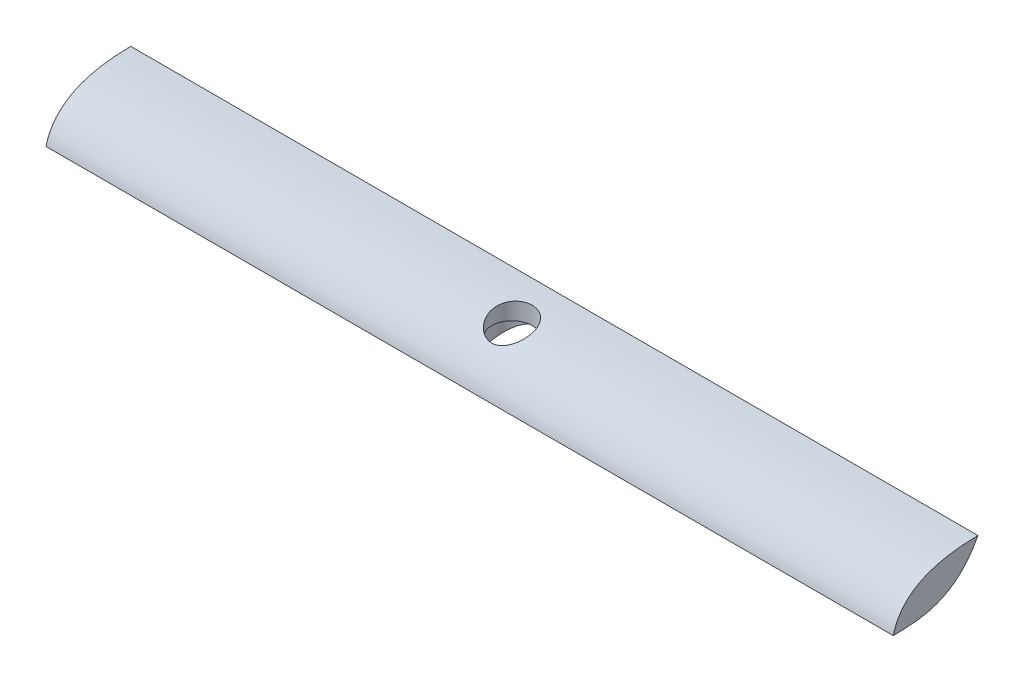
ISO-10303-21;
HEADER;
FILE_DESCRIPTION(('STEP AP214'),'2;1');
FILE_NAME('part.step','',(''),(''),'','','');
FILE_SCHEMA(('AUTOMOTIVE_DESIGN { 1 0 10303 214 1 1 1 1 }'));
ENDSEC;
DATA;
#1=APPLICATION_CONTEXT('core data for automotive mechanical design processes');
#2=APPLICATION_PROTOCOL_DEFINITION('international standard','automotive_design',2000,#1);
#3=PRODUCT_CONTEXT('',#1,'mechanical');
#4=PRODUCT('Part','Part','',(#3));
#5=PRODUCT_RELATED_PRODUCT_CATEGORY('part','',(#4));
#6=PRODUCT_DEFINITION_FORMATION('','',#4);
#7=PRODUCT_DEFINITION_CONTEXT('part definition',#1,'design');
#8=PRODUCT_DEFINITION('design','',#6,#7);
#9=PRODUCT_DEFINITION_SHAPE('','',#8);
#10=(LENGTH_UNIT() NAMED_UNIT(*) SI_UNIT(.MILLI.,.METRE.));
#11=(NAMED_UNIT(*) PLANE_ANGLE_UNIT() SI_UNIT($,.RADIAN.));
#12=(NAMED_UNIT(*) SI_UNIT($,.STERADIAN.) SOLID_ANGLE_UNIT());
#13=UNCERTAINTY_MEASURE_WITH_UNIT(LENGTH_MEASURE(1.E-05),#10,'distance_accuracy_value','');
#14=(GEOMETRIC_REPRESENTATION_CONTEXT(3) GLOBAL_UNCERTAINTY_ASSIGNED_CONTEXT((#13)) GLOBAL_UNIT_ASSIGNED_CONTEXT((#10,
#11,#12)) REPRESENTATION_CONTEXT('',''));
#15=CARTESIAN_POINT('',(0.,0.,0.));
#16=DIRECTION('',(0.,0.,1.));
#17=DIRECTION('',(1.,0.,0.));
#18=AXIS2_PLACEMENT_3D('',#15,#16,#17);
#19=CARTESIAN_POINT('',(-65.,0.,-6.49999999999999));
#20=DIRECTION('',(-1.,0.,0.));
#21=DIRECTION('',(0.,0.,1.));
#22=AXIS2_PLACEMENT_3D('',#19,#20,#21);
#23=PLANE('',#22);
#24=CARTESIAN_POINT('',(-65.,6.8,-6.49999999999999));
#25=CARTESIAN_POINT('',(-65.,6.73763604376101,6.58250357096353));
#26=CARTESIAN_POINT('',(-65.,-2.29750378674827,6.79812167278829));
#27=B_SPLINE_CURVE_WITH_KNOTS('',2,(#24,#25,#26),.UNSPECIFIED.,.F.,.F.,(3,3),(0.,1.),.UNSPECIFIED.);
#28=CARTESIAN_POINT('',(-65.,6.8,-6.49999999999999));
#29=VERTEX_POINT('',#28);
#30=CARTESIAN_POINT('',(-65.,0.,6.50000000000001));
#31=VERTEX_POINT('',#30);
#32=EDGE_CURVE('E73',#29,#31,#27,.T.);
#33=ORIENTED_EDGE('',*,*,#32,.F.);
#34=CARTESIAN_POINT('',(-65.,6.8,-6.49999999999999));
#35=CARTESIAN_POINT('',(-65.,-0.29990601752332,-2.73115202149086));
#36=CARTESIAN_POINT('',(-65.,0.00140559705981155,2.85650159701633));
#37=CARTESIAN_POINT('',(-65.,0.,8.36976424376421));
#38=B_SPLINE_CURVE_WITH_KNOTS('',3,(#34,#35,#36,#37),.UNSPECIFIED.,.F.,.F.,(4,4),(0.,1.),.UNSPECIFIED.);
#39=EDGE_CURVE('E93',#29,#31,#38,.T.);
#40=ORIENTED_EDGE('',*,*,#39,.T.);
#41=EDGE_LOOP('',(#33,#40));
#42=FACE_BOUND('',#41,.T.);
#43=ADVANCED_FACE('F59',(#42),#23,.T.);
#44=CARTESIAN_POINT('',(65.,0.,-6.50000000000001));
#45=DIRECTION('',(1.,0.,0.));
#46=DIRECTION('',(0.,0.,-1.));
#47=AXIS2_PLACEMENT_3D('',#44,#45,#46);
#48=PLANE('',#47);
#49=CARTESIAN_POINT('',(65.,6.8,-6.49999999999999));
#50=CARTESIAN_POINT('',(65.,6.73763604376101,6.58250357096353));
#51=CARTESIAN_POINT('',(65.,-2.29750378674827,6.79812167278829));
#52=B_SPLINE_CURVE_WITH_KNOTS('',2,(#49,#50,#51),.UNSPECIFIED.,.F.,.F.,(3,3),(0.,1.),.UNSPECIFIED.);
#53=CARTESIAN_POINT('',(65.,0.,6.50000000000001));
#54=VERTEX_POINT('',#53);
#55=CARTESIAN_POINT('',(65.,6.8,-6.49999999999999));
#56=VERTEX_POINT('',#55);
#57=EDGE_CURVE('E84',#54,#56,#52,.F.);
#58=ORIENTED_EDGE('',*,*,#57,.F.);
#59=CARTESIAN_POINT('',(65.,6.8,-6.49999999999999));
#60=CARTESIAN_POINT('',(65.,-0.29990601752332,-2.73115202149086));
#61=CARTESIAN_POINT('',(65.,0.00140559705981155,2.85650159701633));
#62=CARTESIAN_POINT('',(65.,0.,8.36976424376421));
#63=B_SPLINE_CURVE_WITH_KNOTS('',3,(#59,#60,#61,#62),.UNSPECIFIED.,.F.,.F.,(4,4),(0.,1.),.UNSPECIFIED.);
#64=EDGE_CURVE('E101',#54,#56,#63,.F.);
#65=ORIENTED_EDGE('',*,*,#64,.T.);
#66=EDGE_LOOP('',(#58,#65));
#67=FACE_BOUND('',#66,.T.);
#68=ADVANCED_FACE('F151',(#67),#48,.T.);
#69=CARTESIAN_POINT('',(0.,3.9,0.));
#70=DIRECTION('',(0.,-1.,0.));
#71=DIRECTION('',(0.,0.,-1.));
#72=AXIS2_PLACEMENT_3D('',#69,#70,#71);
#73=CYLINDRICAL_SURFACE('',#72,4.);
#74=CARTESIAN_POINT('',(0.,3.9,0.));
#75=DIRECTION('',(0.,-1.,0.));
#76=DIRECTION('',(0.,0.,-1.));
#77=AXIS2_PLACEMENT_3D('',#74,#75,#76);
#78=CIRCLE('',#77,4.);
#79=CARTESIAN_POINT('',(0.,3.9,-4.));
#80=VERTEX_POINT('',#79);
#81=EDGE_CURVE('E116',#80,#80,#78,.T.);
#82=ORIENTED_EDGE('',*,*,#81,.F.);
#83=EDGE_LOOP('',(#82));
#84=FACE_BOUND('',#83,.T.);
#85=CARTESIAN_POINT('',(0.,3.33093151060949,-4.));
#86=CARTESIAN_POINT('',(-0.0926897052812048,3.33092979130731,-3.9999987998827));
#87=CARTESIAN_POINT('',(-0.185411880511551,3.32770627442383,-3.99676992655592));
#88=CARTESIAN_POINT('',(-0.370016794581968,3.31492805854923,-3.98392546934574));
#89=CARTESIAN_POINT('',(-0.461898873080675,3.30536875157903,-3.97430523705623));
#90=CARTESIAN_POINT('',(-0.64418677665049,3.28023544091281,-3.94886171598642));
#91=CARTESIAN_POINT('',(-0.734588645163166,3.26464741825143,-3.9330239679096));
#92=CARTESIAN_POINT('',(-0.913044911176231,3.22798370638172,-3.89546909773651));
#93=CARTESIAN_POINT('',(-1.00109806345736,3.20690516760082,-3.87374892243295));
#94=CARTESIAN_POINT('',(-1.25903782017245,3.13687213381971,-3.8008509060467));
#95=CARTESIAN_POINT('',(-1.42479656027469,3.0808073125526,-3.741629760693));
#96=CARTESIAN_POINT('',(-1.74258589766831,2.95483895017978,-3.60464061460903));
#97=CARTESIAN_POINT('',(-1.89461203482855,2.88493093638973,-3.52686661785447));
#98=CARTESIAN_POINT('',(-2.14506733316893,2.75607907318082,-3.37842605917009));
#99=CARTESIAN_POINT('',(-2.24687983548894,2.69927601977032,-3.31151650015241));
#100=CARTESIAN_POINT('',(-2.44278197070121,2.58223898644918,-3.16976980328002));
#101=CARTESIAN_POINT('',(-2.53686868145482,2.52200372282662,-3.09492969012983));
#102=CARTESIAN_POINT('',(-2.7173034672949,2.3993431087602,-2.93778736436292));
#103=CARTESIAN_POINT('',(-2.80364073591291,2.33691486387679,-2.85547504377713));
#104=CARTESIAN_POINT('',(-2.96829462558282,2.2110695004362,-2.68390779037638));
#105=CARTESIAN_POINT('',(-3.0466120706717,2.14765248424838,-2.59465357250298));
#106=CARTESIAN_POINT('',(-3.1960244432352,2.01994042091891,-2.40829475164215));
#107=CARTESIAN_POINT('',(-3.26700662454671,1.95564516527692,-2.31109987197542));
#108=CARTESIAN_POINT('',(-3.40019881390242,1.82792215367898,-2.1102541789104));
#109=CARTESIAN_POINT('',(-3.46240497010857,1.7644947896052,-2.00660055933774));
#110=CARTESIAN_POINT('',(-3.57752461934278,1.63938788440441,-1.7933193582867));
#111=CARTESIAN_POINT('',(-3.63044227771356,1.57770757028919,-1.68369448361193));
#112=CARTESIAN_POINT('',(-3.72643558797859,1.45684358431896,-1.4589712758265));
#113=CARTESIAN_POINT('',(-3.76951631795416,1.39765863721487,-1.34387580402635));
#114=CARTESIAN_POINT('',(-3.84635266668434,1.28072710518582,-1.10531846542228));
#115=CARTESIAN_POINT('',(-3.8797974795975,1.22307372072766,-0.981710190330643));
#116=CARTESIAN_POINT('',(-3.93490424047375,1.11171541287848,-0.730141738562383));
#117=CARTESIAN_POINT('',(-3.95656572052994,1.05801064635719,-0.602181389282656));
#118=CARTESIAN_POINT('',(-3.98739385400134,0.955097447153409,-0.34307322603223));
#119=CARTESIAN_POINT('',(-3.9965686927084,0.905886088694476,-0.211927557567974));
#120=CARTESIAN_POINT('',(-4.00183922878522,0.812291902356351,0.052332054510974));
#121=CARTESIAN_POINT('',(-3.99793710742361,0.767908270475725,0.185445666180435));
#122=CARTESIAN_POINT('',(-3.97795468349815,0.689432886026853,0.435385755658392));
#123=CARTESIAN_POINT('',(-3.96346725179468,0.654748754922482,0.55215572005804));
#124=CARTESIAN_POINT('',(-3.92399206237439,0.589241715997859,0.785000055609693));
#125=CARTESIAN_POINT('',(-3.89900530804535,0.558418439572967,0.901074492156299));
#126=CARTESIAN_POINT('',(-3.83851155591389,0.50056914757278,1.13137053313249));
#127=CARTESIAN_POINT('',(-3.80300812502403,0.47354184910028,1.2455927519419));
#128=CARTESIAN_POINT('',(-3.72159385965111,0.423111875422573,1.4710899627823));
#129=CARTESIAN_POINT('',(-3.67568351496349,0.399709029721801,1.58236509324113));
#130=CARTESIAN_POINT('',(-3.57795567750224,0.358100043502496,1.79177450523749));
#131=CARTESIAN_POINT('',(-3.52694508024282,0.339623767075603,1.89023277440293));
#132=CARTESIAN_POINT('',(-3.4166757024944,0.305301057952949,2.08294359041878));
#133=CARTESIAN_POINT('',(-3.35741427131186,0.289455474004278,2.17719477278298));
#134=CARTESIAN_POINT('',(-3.23107251851472,0.260170821763439,2.360628694732));
#135=CARTESIAN_POINT('',(-3.16399594345451,0.246730608118012,2.44981383270637));
#136=CARTESIAN_POINT('',(-3.02243444081401,0.221995024653336,2.62247155971598));
#137=CARTESIAN_POINT('',(-2.94794678110736,0.210700450330311,2.70594202272692));
#138=CARTESIAN_POINT('',(-2.79317458149744,0.190157674839966,2.86537091143436));
#139=CARTESIAN_POINT('',(-2.71298298397854,0.180883659265783,2.94141628139504));
#140=CARTESIAN_POINT('',(-2.54645286781888,0.163960418201807,3.08671232725365));
#141=CARTESIAN_POINT('',(-2.4601121277257,0.156311783916883,3.15596052588452));
#142=CARTESIAN_POINT('',(-2.28194590765941,0.142437158231549,3.28708887563207));
#143=CARTESIAN_POINT('',(-2.19012235233861,0.136210671270175,3.34897158971228));
#144=CARTESIAN_POINT('',(-2.00157174740584,0.12498770374444,3.46496270524258));
#145=CARTESIAN_POINT('',(-1.90484289273581,0.119991679986567,3.51906821633045));
#146=CARTESIAN_POINT('',(-1.70657850084099,0.11104217406207,3.61939352178205));
#147=CARTESIAN_POINT('',(-1.60501693756388,0.107095330219004,3.66556248031321));
#148=CARTESIAN_POINT('',(-1.39832720335538,0.100144646205887,3.74928235778143));
#149=CARTESIAN_POINT('',(-1.29319772685618,0.097141155440581,3.78683008215263));
#150=CARTESIAN_POINT('',(-1.08018666028723,0.0919683189853375,3.85300280557123));
#151=CARTESIAN_POINT('',(-0.97230602243252,0.0897986887533595,3.88163084769013));
#152=CARTESIAN_POINT('',(-0.754478337693747,0.0862074787292863,3.92978488670386));
#153=CARTESIAN_POINT('',(-0.644530541315485,0.0847861758965445,3.94930751333852));
#154=CARTESIAN_POINT('',(-0.422930612626965,0.0826317707125092,3.97915557129687));
#155=CARTESIAN_POINT('',(-0.311273367208,0.0819014909239795,3.98944327281003));
#156=CARTESIAN_POINT('',(-0.0874477415788085,0.081109175278041,4.00061439161435));
#157=CARTESIAN_POINT('',(0.0247208126296079,0.0810473870271499,4.00149432430518));
#158=CARTESIAN_POINT('',(0.24870163180405,0.081589861033504,3.99383182122871));
#159=CARTESIAN_POINT('',(0.360514010222194,0.0821938841849455,3.98529276800139));
#160=CARTESIAN_POINT('',(0.583034358064106,0.0840934318463609,3.9588696480839));
#161=CARTESIAN_POINT('',(0.693741904388116,0.0853892116409055,3.94098213150569));
#162=CARTESIAN_POINT('',(1.02315960834855,0.0903883447004827,3.87340890552532));
#163=CARTESIAN_POINT('',(1.23917632483221,0.0952035102761804,3.80981211698592));
#164=CARTESIAN_POINT('',(1.6572996740606,0.10853636240006,3.64742777375364));
#165=CARTESIAN_POINT('',(1.85940628769292,0.117054054035376,3.54864017070991));
#166=CARTESIAN_POINT('',(2.24382613937045,0.138989122893849,3.3189273632328));
#167=CARTESIAN_POINT('',(2.42616555949507,0.152399913654765,3.18804543735908));
#168=CARTESIAN_POINT('',(2.76609979489334,0.185738491054578,2.8980354435829));
#169=CARTESIAN_POINT('',(2.92369557440138,0.205666023649369,2.73890847687591));
#170=CARTESIAN_POINT('',(3.20897002197713,0.253827826290886,2.39825163645113));
#171=CARTESIAN_POINT('',(3.33679569665019,0.282019655848074,2.21683890831824));
#172=CARTESIAN_POINT('',(3.56013146241421,0.348674643520695,1.83685024663903));
#173=CARTESIAN_POINT('',(3.65564569198091,0.387136485114793,1.63827651518109));
#174=CARTESIAN_POINT('',(3.81180785589129,0.475674011468515,1.23176516193126));
#175=CARTESIAN_POINT('',(3.87266385914037,0.52567780110316,1.02389167781445));
#176=CARTESIAN_POINT('',(3.95987481916003,0.638291560673613,0.604401248324751));
#177=CARTESIAN_POINT('',(3.98622932067974,0.700901696938888,0.392784253593188));
#178=CARTESIAN_POINT('',(4.00560048574829,0.839729236338388,-0.031302562497683));
#179=CARTESIAN_POINT('',(3.99805996827246,0.916154090717605,-0.243728855011822));
#180=CARTESIAN_POINT('',(3.95070086027547,1.08061341154998,-0.660263020507576));
#181=CARTESIAN_POINT('',(3.91087467178441,1.16865060671727,-0.864368923528277));
#182=CARTESIAN_POINT('',(3.79777425016074,1.36110570308447,-1.27501842772932));
#183=CARTESIAN_POINT('',(3.72219485967198,1.46625927907592,-1.48057551925184));
#184=CARTESIAN_POINT('',(3.5405785180172,1.68379869744024,-1.87384290393282));
#185=CARTESIAN_POINT('',(3.43451372586797,1.79619107756367,-2.06153667378071));
#186=CARTESIAN_POINT('',(3.24713368968272,1.97388254807597,-2.33895181715804));
#187=CARTESIAN_POINT('',(3.17519558371113,2.03834487571176,-2.43570403601801));
#188=CARTESIAN_POINT('',(3.02282487984682,2.16718222190112,-2.62241244470258));
#189=CARTESIAN_POINT('',(2.94239086961133,2.23155722413064,-2.7123675003028));
#190=CARTESIAN_POINT('',(2.77328523250334,2.3591500798889,-2.88504678625139));
#191=CARTESIAN_POINT('',(2.6846141965991,2.42236801604279,-2.96777153451541));
#192=CARTESIAN_POINT('',(2.49917529367561,2.54644902720741,-3.12553024047723));
#193=CARTESIAN_POINT('',(2.40240961363591,2.60731273181811,-3.20056626337338));
#194=CARTESIAN_POINT('',(2.22298751834006,2.71234233784117,-3.32679458298174));
#195=CARTESIAN_POINT('',(2.14189912824279,2.75723998426424,-3.379604420471));
#196=CARTESIAN_POINT('',(1.97490988059505,2.8439942771482,-3.47983313661673));
#197=CARTESIAN_POINT('',(1.88900752238311,2.88584996589291,-3.52725032010565));
#198=CARTESIAN_POINT('',(1.62434944469154,3.00547477024527,-3.66065026334418));
#199=CARTESIAN_POINT('',(1.43827829206843,3.07752247210948,-3.73804144306646));
#200=CARTESIAN_POINT('',(1.16651011723966,3.16198222095105,-3.82700647433133));
#201=CARTESIAN_POINT('',(1.08746611458538,3.18426205702416,-3.85023366579775));
#202=CARTESIAN_POINT('',(0.927087686771786,3.22456608780557,-3.89196066115252));
#203=CARTESIAN_POINT('',(0.845754448271094,3.24259244349643,-3.91046286596725));
#204=CARTESIAN_POINT('',(0.681400730610432,3.27388781479511,-3.94242176823952));
#205=CARTESIAN_POINT('',(0.598384483045223,3.28716749677626,-3.95588978131737));
#206=CARTESIAN_POINT('',(0.431050467870024,3.30864041937055,-3.97760022567914));
#207=CARTESIAN_POINT('',(0.346733491593785,3.31683663656955,-3.985845715034));
#208=CARTESIAN_POINT('',(0.218529561116081,3.3252154783508,-3.99426504167127));
#209=CARTESIAN_POINT('',(0.174884988615253,3.32735676541724,-3.99641411455768));
#210=CARTESIAN_POINT('',(0.0874960320426818,3.33021530009866,-3.99928199023405));
#211=CARTESIAN_POINT('',(0.0437516332598872,3.33093232215893,-4.00000056648246));
#212=CARTESIAN_POINT('',(0.,3.33093151060949,-4.));
#213=B_SPLINE_CURVE_WITH_KNOTS('',3,(#85,#86,#87,#88,#89,#90,#91,#92,#93,#94,#95,#96,#97,#98,
#99,#100,#101,#102,#103,#104,#105,#106,#107,#108,#109,#110,#111,#112,#113,#114,#115,#116,#117,
#118,#119,#120,#121,#122,#123,#124,#125,#126,#127,#128,#129,#130,#131,#132,#133,#134,#135,#136,
#137,#138,#139,#140,#141,#142,#143,#144,#145,#146,#147,#148,#149,#150,#151,#152,#153,#154,#155,
#156,#157,#158,#159,#160,#161,#162,#163,#164,#165,#166,#167,#168,#169,#170,#171,#172,#173,#174,
#175,#176,#177,#178,#179,#180,#181,#182,#183,#184,#185,#186,#187,#188,#189,#190,#191,#192,#193,
#194,#195,#196,#197,#198,#199,#200,#201,#202,#203,#204,#205,#206,#207,#208,#209,#210,#211,#212),
.UNSPECIFIED.,.T.,.F.,(4,2,2,2,2,2,2,2,2,2,2,2,2,2,2,2,2,2,2,2,2,2,2,2,2,2,2,2,2,2,2,2,2,2,2,2,
2,2,2,2,2,2,2,2,2,2,2,2,2,2,2,2,2,2,2,2,2,2,2,2,2,2,2,4),(0.,0.278014586324024,
0.556231593059284,0.835099483958665,1.1141123964038,1.66581323563521,2.21769261906962,
2.6204651811033,3.02338938939131,3.426867011942,3.83030313547518,4.23922747103943,
4.64833073071069,5.05725006040363,5.46595781551186,5.88666125070152,6.30738139047488,
6.72782560508731,7.1481996920769,7.51571940159693,7.88320399638074,8.25056409484837,
8.61790690731214,8.95475141879166,9.29170439697282,9.62849650054855,9.96541322721227,
10.2977337840408,10.6301750107182,10.9625002177042,11.294948614275,11.6294529286679,
11.9640809930592,12.2985947691896,12.6332322635073,12.9692307965941,13.3053537778976,
13.6413560902258,13.9774824860186,14.6497012092938,15.3219208561755,15.993238965471,
16.6645309076897,17.3324341461361,18.0002518065843,18.6640168102905,19.3277905723561,
20.0025152758903,20.6773988123242,21.4034046075981,22.1300755504443,22.5398595226781,
22.9497117241445,23.3595345433002,23.7692469935335,24.0889869350616,24.4088271098561,
25.0470236251221,25.3028643613138,25.558574836289,25.8137070306429,26.0686896928064,
26.1998980761706,26.331127236786),.UNSPECIFIED.);
#214=CARTESIAN_POINT('',(0.,3.33093151060949,-4.));
#215=VERTEX_POINT('',#214);
#216=EDGE_CURVE('E98',#215,#215,#213,.T.);
#217=ORIENTED_EDGE('',*,*,#216,.F.);
#218=EDGE_LOOP('',(#217));
#219=FACE_BOUND('',#218,.T.);
#220=ADVANCED_FACE('F132',(#84,#219),#73,.F.);
#221=CARTESIAN_POINT('',(0.,2.9,0.));
#222=DIRECTION('',(0.,1.,0.));
#223=DIRECTION('',(0.,0.,1.));
#224=AXIS2_PLACEMENT_3D('',#221,#222,#223);
#225=CYLINDRICAL_SURFACE('',#224,3.1);
#226=CARTESIAN_POINT('',(0.,4.66943040540913,3.1));
#227=CARTESIAN_POINT('',(0.078972843305734,4.66942770965029,3.10000251307535));
#228=CARTESIAN_POINT('',(0.157922988625779,4.67134611835439,3.09697989818374));
#229=CARTESIAN_POINT('',(0.315205295306126,4.67895477743792,3.08494129392374));
#230=CARTESIAN_POINT('',(0.393537338709321,4.68464573094884,3.07592418729381));
#231=CARTESIAN_POINT('',(0.549002130717159,4.69964164214147,3.05201342263359));
#232=CARTESIAN_POINT('',(0.626134001884785,4.70894912559217,3.03711565746084));
#233=CARTESIAN_POINT('',(0.778607748715093,4.73091364026653,3.00165082440342));
#234=CARTESIAN_POINT('',(0.853948857123247,4.74357207999202,2.98108137239655));
#235=CARTESIAN_POINT('',(1.07573057205907,4.78594722336042,2.91147322160138));
#236=CARTESIAN_POINT('',(1.21887977750238,4.82016165213859,2.85438470459069));
#237=CARTESIAN_POINT('',(1.49311551469239,4.8976158707873,2.72101497291011));
#238=CARTESIAN_POINT('',(1.62419939843286,4.94085763513632,2.64472955870205));
#239=CARTESIAN_POINT('',(1.88280674412655,5.03729042540985,2.46810343441663));
#240=CARTESIAN_POINT('',(2.00912631786703,5.09100992900084,2.36628927011903));
#241=CARTESIAN_POINT('',(2.24357063698546,5.2023119778516,2.1453145063865));
#242=CARTESIAN_POINT('',(2.35168727801674,5.25989622790787,2.02614622431887));
#243=CARTESIAN_POINT('',(2.56012573210472,5.38334659945282,1.75730128715277));
#244=CARTESIAN_POINT('',(2.65785845014477,5.44936111600751,1.60567518822402));
#245=CARTESIAN_POINT('',(2.82587288944852,5.57968737260273,1.28719373352137));
#246=CARTESIAN_POINT('',(2.89614757151295,5.64399867206902,1.12033448605315));
#247=CARTESIAN_POINT('',(3.00836344111945,5.77015488231752,0.770900988216469));
#248=CARTESIAN_POINT('',(3.04950276397476,5.83188896378306,0.588027108286938));
#249=CARTESIAN_POINT('',(3.09815694663899,5.94906995437789,0.215888369311998));
#250=CARTESIAN_POINT('',(3.10568032701127,6.00451845322755,0.026625142017007));
#251=CARTESIAN_POINT('',(3.08618738058946,6.10574295827777,-0.344174259966836));
#252=CARTESIAN_POINT('',(3.06060801235863,6.15182733324568,-0.52570121602383));
#253=CARTESIAN_POINT('',(2.97723721419667,6.23662011638545,-0.882995001920823));
#254=CARTESIAN_POINT('',(2.91945456948441,6.2753305323482,-1.05876338888763));
#255=CARTESIAN_POINT('',(2.77632160617076,6.34374096589313,-1.39036071358047));
#256=CARTESIAN_POINT('',(2.69240528652529,6.37378069376808,-1.54673961964232));
#257=CARTESIAN_POINT('',(2.49850213864659,6.42755534877465,-1.84361141051575));
#258=CARTESIAN_POINT('',(2.38851927589887,6.45129123374204,-1.98410670689297));
#259=CARTESIAN_POINT('',(2.14866321152246,6.49250316380589,-2.24129206135584));
#260=CARTESIAN_POINT('',(2.01936256025713,6.51012217620163,-2.35849375743107));
#261=CARTESIAN_POINT('',(1.74257807346655,6.54052453095789,-2.56977192827147));
#262=CARTESIAN_POINT('',(1.59509518427682,6.55330812484788,-2.66384960581591));
#263=CARTESIAN_POINT('',(1.28742594816691,6.57453188088982,-2.82532827545179));
#264=CARTESIAN_POINT('',(1.12735125402852,6.58300613333863,-2.89293763913903));
#265=CARTESIAN_POINT('',(0.798025185812468,6.59621917275403,-3.00052700951416));
#266=CARTESIAN_POINT('',(0.628773892240951,6.60095799248584,-3.0405072585495));
#267=CARTESIAN_POINT('',(0.286130524981807,6.60698050709291,-3.0916171655355));
#268=CARTESIAN_POINT('',(0.112743964226917,6.60826856813652,-3.10278328071097));
#269=CARTESIAN_POINT('',(-0.233455532882783,6.60748341524424,-3.09604150445544));
#270=CARTESIAN_POINT('',(-0.406268469822093,6.60541020473441,-3.07813364265883));
#271=CARTESIAN_POINT('',(-0.74641719700208,6.59777258271654,-3.01377211444994));
#272=CARTESIAN_POINT('',(-0.913752910482092,6.59220812230233,-2.96731804815652));
#273=CARTESIAN_POINT('',(-1.23819299233786,6.57726193123291,-2.84724374370275));
#274=CARTESIAN_POINT('',(-1.39529743863405,6.56788022965342,-2.77362371246447));
#275=CARTESIAN_POINT('',(-1.69482302934889,6.54481663143996,-2.60142563553146));
#276=CARTESIAN_POINT('',(-1.83724439574061,6.53113479982633,-2.50284796721443));
#277=CARTESIAN_POINT('',(-2.10340437485943,6.49889482474357,-2.2837256785986));
#278=CARTESIAN_POINT('',(-2.2271432758859,6.48033675653444,-2.16318139734204));
#279=CARTESIAN_POINT('',(-2.45270268595243,6.43773169376677,-1.90364068188283));
#280=CARTESIAN_POINT('',(-2.55449347613409,6.41367734656292,-1.76461963556561));
#281=CARTESIAN_POINT('',(-2.73330665050367,6.35960500587405,-1.47253495152575));
#282=CARTESIAN_POINT('',(-2.81032904974241,6.32958701601293,-1.31947132233633));
#283=CARTESIAN_POINT('',(-2.93837784342068,6.26303253207109,-1.00267659601019));
#284=CARTESIAN_POINT('',(-2.98918855585534,6.22644519409665,-0.838869116577872));
#285=CARTESIAN_POINT('',(-3.06305613005971,6.14693913344669,-0.506617510575506));
#286=CARTESIAN_POINT('',(-3.08611040474148,6.10401982100673,-0.338172953294856));
#287=CARTESIAN_POINT('',(-3.10480603780663,6.01114446028165,0.00265817691146521));
#288=CARTESIAN_POINT('',(-3.09977294161818,5.96104368268284,0.175041857597535));
#289=CARTESIAN_POINT('',(-3.06170733318113,5.85551656615276,0.515002221734185));
#290=CARTESIAN_POINT('',(-3.02866929659928,5.80008917839223,0.682577950011228));
#291=CARTESIAN_POINT('',(-2.93409262693513,5.68271278700303,1.01610606693276));
#292=CARTESIAN_POINT('',(-2.87134877341276,5.62058318487169,1.18165284174326));
#293=CARTESIAN_POINT('',(-2.71914790765779,5.49411992656948,1.49908341518548));
#294=CARTESIAN_POINT('',(-2.62968163918062,5.42978551353196,1.65096245575855));
#295=CARTESIAN_POINT('',(-2.42151179921858,5.29868844693642,1.94424406739738));
#296=CARTESIAN_POINT('',(-2.30164705832298,5.23195115605871,2.08483685076601));
#297=CARTESIAN_POINT('',(-2.03755462486827,5.10301720566758,2.34363114675921));
#298=CARTESIAN_POINT('',(-1.89331313948038,5.04082314549543,2.46181990197945));
#299=CARTESIAN_POINT('',(-1.58492417709166,4.9266176740495,2.67061348985571));
#300=CARTESIAN_POINT('',(-1.42103187389643,4.87449469305847,2.76152756776493));
#301=CARTESIAN_POINT('',(-1.16272420518869,4.80755525321291,2.87522861845235));
#302=CARTESIAN_POINT('',(-1.07459769049189,4.78712479964147,2.90933751574578));
#303=CARTESIAN_POINT('',(-0.894794907727257,4.75064789532128,2.96956483142584));
#304=CARTESIAN_POINT('',(-0.803120399501984,4.73459930215153,2.99568715543503));
#305=CARTESIAN_POINT('',(-0.594599288645581,4.70422870869184,3.04475216725651));
#306=CARTESIAN_POINT('',(-0.47700783862353,4.69125348203761,3.06541377479422));
#307=CARTESIAN_POINT('',(-0.239593201695688,4.67385728851096,3.09303432153444));
#308=CARTESIAN_POINT('',(-0.119770497183402,4.66943449380664,3.09999618866091));
#309=CARTESIAN_POINT('',(0.,4.66943040540913,3.1));
#310=B_SPLINE_CURVE_WITH_KNOTS('',3,(#226,#227,#228,#229,#230,#231,#232,#233,#234,#235,#236,
#237,#238,#239,#240,#241,#242,#243,#244,#245,#246,#247,#248,#249,#250,#251,#252,#253,#254,#255,
#256,#257,#258,#259,#260,#261,#262,#263,#264,#265,#266,#267,#268,#269,#270,#271,#272,#273,#274,
#275,#276,#277,#278,#279,#280,#281,#282,#283,#284,#285,#286,#287,#288,#289,#290,#291,#292,#293,
#294,#295,#296,#297,#298,#299,#300,#301,#302,#303,#304,#305,#306,#307,#308,#309),.UNSPECIFIED.,
.T.,.F.,(4,2,2,2,2,2,2,2,2,2,2,2,2,2,2,2,2,2,2,2,2,2,2,2,2,2,2,2,2,2,2,2,2,2,2,2,2,2,2,2,2,4),
(0.,0.236798523644941,0.473641194500429,0.710649573431216,0.947757732313352,1.41911025851398,
1.89056598818102,2.40125179576634,2.91216437409275,3.485839451983,4.05966150206671,
4.64871984483093,5.23762887172381,5.80181132481326,6.36583994132402,6.90317683293474,
7.44043203225977,7.96411734965827,8.48777542217264,9.00722385862619,9.52666773870504,
10.0454540668815,10.5642398662719,11.0830329330867,11.6018220483569,12.1206033196252,
12.6393765844764,13.1588479438229,13.6783189875056,14.20199890835,14.725727635931,
15.2620858113022,15.798549814823,16.3589361614462,16.9195168430649,17.5060328883879,
18.0928819136745,18.6728011127635,18.9624278666412,19.2519127588289,19.6111190267462,
19.9702485163538),.UNSPECIFIED.);
#311=CARTESIAN_POINT('',(0.,4.66943040540913,3.1));
#312=VERTEX_POINT('',#311);
#313=EDGE_CURVE('E94',#312,#312,#310,.T.);
#314=ORIENTED_EDGE('',*,*,#313,.T.);
#315=EDGE_LOOP('',(#314));
#316=FACE_BOUND('',#315,.T.);
#317=CARTESIAN_POINT('',(0.,3.9,0.));
#318=DIRECTION('',(0.,-1.,0.));
#319=DIRECTION('',(0.,0.,-1.));
#320=AXIS2_PLACEMENT_3D('',#317,#318,#319);
#321=CIRCLE('',#320,3.1);
#322=CARTESIAN_POINT('',(0.,3.9,-3.1));
#323=VERTEX_POINT('',#322);
#324=EDGE_CURVE('E89',#323,#323,#321,.F.);
#325=ORIENTED_EDGE('',*,*,#324,.F.);
#326=EDGE_LOOP('',(#325));
#327=FACE_BOUND('',#326,.T.);
#328=ADVANCED_FACE('F143',(#316,#327),#225,.F.);
#329=CARTESIAN_POINT('',(0.,3.9,0.));
#330=DIRECTION('',(0.,-1.,0.));
#331=DIRECTION('',(0.,0.,-1.));
#332=AXIS2_PLACEMENT_3D('',#329,#330,#331);
#333=PLANE('',#332);
#334=ORIENTED_EDGE('',*,*,#81,.T.);
#335=EDGE_LOOP('',(#334));
#336=FACE_BOUND('',#335,.T.);
#337=ORIENTED_EDGE('',*,*,#324,.T.);
#338=EDGE_LOOP('',(#337));
#339=FACE_BOUND('',#338,.T.);
#340=ADVANCED_FACE('F139',(#336,#339),#333,.T.);
#341=CARTESIAN_POINT('',(85.,6.8,-6.49999999999999));
#342=CARTESIAN_POINT('',(85.,-0.29990601752332,-2.73115202149086));
#343=CARTESIAN_POINT('',(85.,0.00140559705981155,2.85650159701633));
#344=CARTESIAN_POINT('',(85.,0.,8.36976424376421));
#345=B_SPLINE_CURVE_WITH_KNOTS('',3,(#341,#342,#343,#344),.UNSPECIFIED.,.F.,.F.,(4,4),(0.,1.),.UNSPECIFIED.);
#346=DIRECTION('',(-1.,0.,0.));
#347=VECTOR('',#346,1.);
#348=SURFACE_OF_LINEAR_EXTRUSION('',#345,#347);
#349=DIRECTION('',(1.,0.,0.));
#350=VECTOR('',#349,1.);
#351=CARTESIAN_POINT('',(-65.,0.,6.50000000000001));
#352=LINE('',#351,#350);
#353=EDGE_CURVE('E12',#31,#54,#352,.T.);
#354=ORIENTED_EDGE('',*,*,#353,.F.);
#355=ORIENTED_EDGE('',*,*,#39,.F.);
#356=DIRECTION('',(-1.,0.,0.));
#357=VECTOR('',#356,1.);
#358=CARTESIAN_POINT('',(-65.,6.8,-6.49999999999999));
#359=LINE('',#358,#357);
#360=EDGE_CURVE('E67',#56,#29,#359,.T.);
#361=ORIENTED_EDGE('',*,*,#360,.F.);
#362=ORIENTED_EDGE('',*,*,#64,.F.);
#363=EDGE_LOOP('',(#354,#355,#361,#362));
#364=FACE_BOUND('',#363,.T.);
#365=ORIENTED_EDGE('',*,*,#216,.T.);
#366=EDGE_LOOP('',(#365));
#367=FACE_BOUND('',#366,.T.);
#368=ADVANCED_FACE('F96',(#364,#367),#348,.T.);
#369=CARTESIAN_POINT('',(85.,6.8,-6.49999999999999));
#370=CARTESIAN_POINT('',(85.,6.73763604376101,6.58250357096353));
#371=CARTESIAN_POINT('',(85.,-2.29750378674827,6.79812167278829));
#372=B_SPLINE_CURVE_WITH_KNOTS('',2,(#369,#370,#371),.UNSPECIFIED.,.F.,.F.,(3,3),(0.,1.),.UNSPECIFIED.);
#373=DIRECTION('',(-1.,0.,0.));
#374=VECTOR('',#373,1.);
#375=SURFACE_OF_LINEAR_EXTRUSION('',#372,#374);
#376=ORIENTED_EDGE('',*,*,#57,.T.);
#377=ORIENTED_EDGE('',*,*,#360,.T.);
#378=ORIENTED_EDGE('',*,*,#32,.T.);
#379=ORIENTED_EDGE('',*,*,#353,.T.);
#380=EDGE_LOOP('',(#376,#377,#378,#379));
#381=FACE_BOUND('',#380,.T.);
#382=ORIENTED_EDGE('',*,*,#313,.F.);
#383=EDGE_LOOP('',(#382));
#384=FACE_BOUND('',#383,.T.);
#385=ADVANCED_FACE('F82',(#381,#384),#375,.F.);
#386=CLOSED_SHELL('',(#43,#68,#220,#328,#340,#368,#385));
#387=MANIFOLD_SOLID_BREP('B2',#386);
#388=ADVANCED_BREP_SHAPE_REPRESENTATION('',(#18,#387),#14);
#389=SHAPE_DEFINITION_REPRESENTATION(#9,#388);
ENDSEC;
END-ISO-10303-21;
